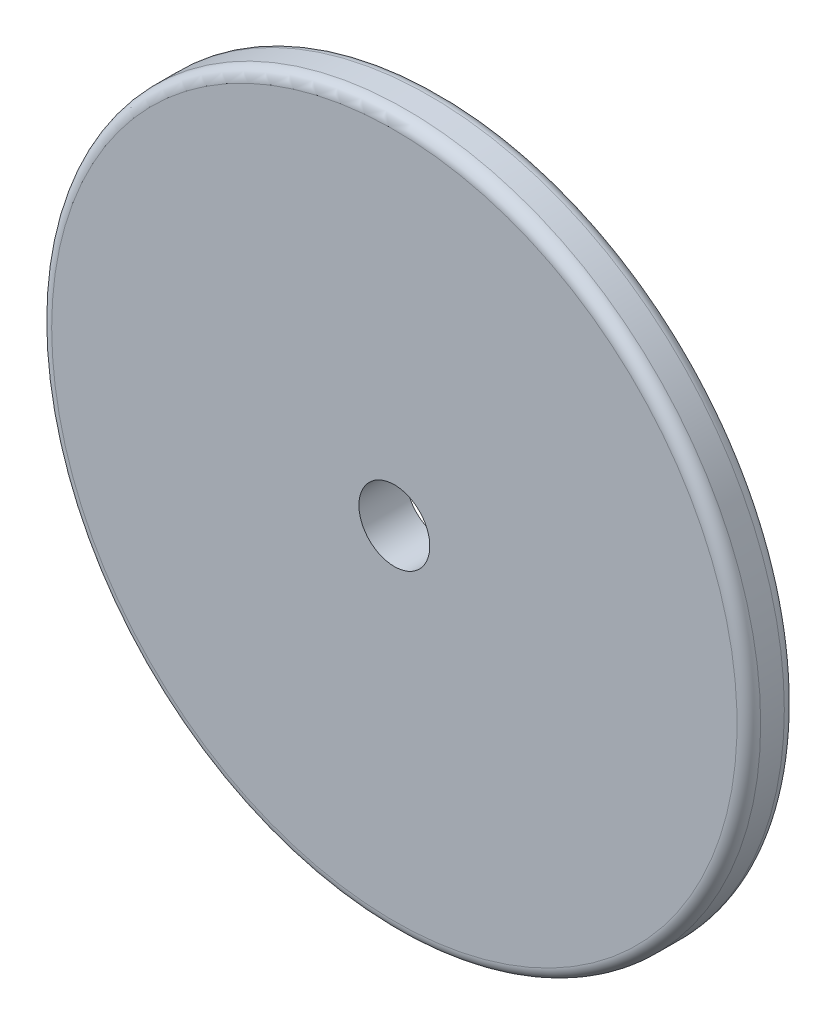
ISO-10303-21;
HEADER;
FILE_DESCRIPTION(('STEP AP214'),'2;1');
FILE_NAME('part.step','',(''),(''),'','','');
FILE_SCHEMA(('AUTOMOTIVE_DESIGN { 1 0 10303 214 1 1 1 1 }'));
ENDSEC;
DATA;
#1=APPLICATION_CONTEXT('core data for automotive mechanical design processes');
#2=APPLICATION_PROTOCOL_DEFINITION('international standard','automotive_design',2000,#1);
#3=PRODUCT_CONTEXT('',#1,'mechanical');
#4=PRODUCT('Part','Part','',(#3));
#5=PRODUCT_RELATED_PRODUCT_CATEGORY('part','',(#4));
#6=PRODUCT_DEFINITION_FORMATION('','',#4);
#7=PRODUCT_DEFINITION_CONTEXT('part definition',#1,'design');
#8=PRODUCT_DEFINITION('design','',#6,#7);
#9=PRODUCT_DEFINITION_SHAPE('','',#8);
#10=(LENGTH_UNIT() NAMED_UNIT(*) SI_UNIT(.MILLI.,.METRE.));
#11=(NAMED_UNIT(*) PLANE_ANGLE_UNIT() SI_UNIT($,.RADIAN.));
#12=(NAMED_UNIT(*) SI_UNIT($,.STERADIAN.) SOLID_ANGLE_UNIT());
#13=UNCERTAINTY_MEASURE_WITH_UNIT(LENGTH_MEASURE(1.E-05),#10,'distance_accuracy_value','');
#14=(GEOMETRIC_REPRESENTATION_CONTEXT(3) GLOBAL_UNCERTAINTY_ASSIGNED_CONTEXT((#13)) GLOBAL_UNIT_ASSIGNED_CONTEXT((#10,
#11,#12)) REPRESENTATION_CONTEXT('',''));
#15=CARTESIAN_POINT('',(0.,0.,0.));
#16=DIRECTION('',(0.,0.,1.));
#17=DIRECTION('',(1.,0.,0.));
#18=AXIS2_PLACEMENT_3D('',#15,#16,#17);
#19=CARTESIAN_POINT('',(22.8892980415492,-137.110087716454,39.8908939446721));
#20=DIRECTION('',(0.000168930064064378,7.32006556775608E-05,-0.999999983052149));
#21=DIRECTION('',(-0.999999985731317,0.,-0.00016893006451697));
#22=AXIS2_PLACEMENT_3D('',#19,#20,#21);
#23=PLANE('',#22);
#24=CARTESIAN_POINT('',(22.8892980415492,-137.110087716454,39.8908939446721));
#25=DIRECTION('',(0.000168930064064378,7.32006556775608E-05,-0.999999983052149));
#26=DIRECTION('',(-0.999999985731317,0.,-0.00016893006451697));
#27=AXIS2_PLACEMENT_3D('',#24,#25,#26);
#28=CIRCLE('',#27,14.5);
#29=CARTESIAN_POINT('',(8.38929824844514,-137.110087716454,39.8884444587366));
#30=VERTEX_POINT('',#29);
#31=EDGE_CURVE('E39',#30,#30,#28,.T.);
#32=ORIENTED_EDGE('',*,*,#31,.T.);
#33=EDGE_LOOP('',(#32));
#34=FACE_BOUND('',#33,.T.);
#35=CARTESIAN_POINT('',(22.8892980415492,-137.110087716454,39.8908939446721));
#36=DIRECTION('',(0.000168930064064378,7.32006556775608E-05,-0.999999983052149));
#37=DIRECTION('',(-0.999999985731317,0.,-0.00016893006451697));
#38=AXIS2_PLACEMENT_3D('',#35,#36,#37);
#39=CIRCLE('',#38,1.5);
#40=CARTESIAN_POINT('',(21.3892980629523,-137.110087716454,39.8906405495753));
#41=VERTEX_POINT('',#40);
#42=EDGE_CURVE('E52',#41,#41,#39,.T.);
#43=ORIENTED_EDGE('',*,*,#42,.F.);
#44=EDGE_LOOP('',(#43));
#45=FACE_BOUND('',#44,.T.);
#46=ADVANCED_FACE('F32',(#34,#45),#23,.T.);
#47=CARTESIAN_POINT('',(22.8889601814211,-137.110234117765,41.8908939107764));
#48=DIRECTION('',(0.000168930064064378,7.32006556775608E-05,-0.999999983052149));
#49=DIRECTION('',(-0.999999985731317,0.,-0.00016893006451697));
#50=AXIS2_PLACEMENT_3D('',#47,#48,#49);
#51=PLANE('',#50);
#52=CARTESIAN_POINT('',(22.8889601814211,-137.110234117765,41.8908939107764));
#53=DIRECTION('',(0.000168930064064378,7.32006556775608E-05,-0.999999983052149));
#54=DIRECTION('',(-0.999999985731317,0.,-0.00016893006451697));
#55=AXIS2_PLACEMENT_3D('',#52,#53,#54);
#56=CIRCLE('',#55,14.5);
#57=CARTESIAN_POINT('',(8.38896038831702,-137.110234117765,41.8884444248409));
#58=VERTEX_POINT('',#57);
#59=EDGE_CURVE('E43',#58,#58,#56,.F.);
#60=ORIENTED_EDGE('',*,*,#59,.T.);
#61=EDGE_LOOP('',(#60));
#62=FACE_BOUND('',#61,.T.);
#63=CARTESIAN_POINT('',(22.8889601814211,-137.110234117765,41.8908939107764));
#64=DIRECTION('',(0.000168930064064378,7.32006556775608E-05,-0.999999983052149));
#65=DIRECTION('',(-0.999999985731317,0.,-0.00016893006451697));
#66=AXIS2_PLACEMENT_3D('',#63,#64,#65);
#67=CIRCLE('',#66,1.5);
#68=CARTESIAN_POINT('',(21.3889602028241,-137.110234117765,41.8906405156796));
#69=VERTEX_POINT('',#68);
#70=EDGE_CURVE('E53',#69,#69,#67,.T.);
#71=ORIENTED_EDGE('',*,*,#70,.T.);
#72=EDGE_LOOP('',(#71));
#73=FACE_BOUND('',#72,.T.);
#74=ADVANCED_FACE('F63',(#62,#73),#51,.F.);
#75=CARTESIAN_POINT('',(22.8892980415492,-137.110087716454,39.8908939446721));
#76=DIRECTION('',(-0.000168930064064378,-7.32006556775608E-05,0.999999983052148));
#77=DIRECTION('',(0.999999985731317,0.,0.00016893006451697));
#78=AXIS2_PLACEMENT_3D('',#75,#76,#77);
#79=CYLINDRICAL_SURFACE('',#78,15.);
#80=CARTESIAN_POINT('',(22.8892135765172,-137.110124316782,40.3908939361982));
#81=DIRECTION('',(0.000168930064064378,7.32006556775608E-05,-0.999999983052149));
#82=DIRECTION('',(-0.999999985731317,0.,-0.00016893006451697));
#83=AXIS2_PLACEMENT_3D('',#80,#81,#82);
#84=CIRCLE('',#83,15.);
#85=CARTESIAN_POINT('',(7.88921379054745,-137.110124316782,40.3883599852304));
#86=VERTEX_POINT('',#85);
#87=EDGE_CURVE('E10',#86,#86,#84,.F.);
#88=ORIENTED_EDGE('',*,*,#87,.T.);
#89=EDGE_LOOP('',(#88));
#90=FACE_BOUND('',#89,.T.);
#91=CARTESIAN_POINT('',(22.8890446464531,-137.110197517437,41.3908939192503));
#92=DIRECTION('',(0.000168930064064378,7.32006556775608E-05,-0.999999983052149));
#93=DIRECTION('',(-0.999999985731317,0.,-0.00016893006451697));
#94=AXIS2_PLACEMENT_3D('',#91,#92,#93);
#95=CIRCLE('',#94,15.);
#96=CARTESIAN_POINT('',(7.88904486048339,-137.110197517437,41.3883599682826));
#97=VERTEX_POINT('',#96);
#98=EDGE_CURVE('E47',#97,#97,#95,.T.);
#99=ORIENTED_EDGE('',*,*,#98,.T.);
#100=EDGE_LOOP('',(#99));
#101=FACE_BOUND('',#100,.T.);
#102=ADVANCED_FACE('F68',(#90,#101),#79,.T.);
#103=CARTESIAN_POINT('',(22.8892980415492,-137.110087716454,39.8908939446721));
#104=DIRECTION('',(-0.000168930064064378,-7.32006556775608E-05,0.999999983052148));
#105=DIRECTION('',(0.999999985731317,0.,0.00016893006451697));
#106=AXIS2_PLACEMENT_3D('',#103,#104,#105);
#107=CYLINDRICAL_SURFACE('',#106,1.5);
#108=ORIENTED_EDGE('',*,*,#42,.T.);
#109=EDGE_LOOP('',(#108));
#110=FACE_BOUND('',#109,.T.);
#111=ORIENTED_EDGE('',*,*,#70,.F.);
#112=EDGE_LOOP('',(#111));
#113=FACE_BOUND('',#112,.T.);
#114=ADVANCED_FACE('F59',(#110,#113),#107,.F.);
#115=CARTESIAN_POINT('',(22.8890446464531,-137.110197517437,41.3908939192503));
#116=DIRECTION('',(0.000168930064064378,7.32006556775608E-05,-0.999999983052149));
#117=DIRECTION('',(-0.999999985731317,0.,-0.00016893006451697));
#118=AXIS2_PLACEMENT_3D('',#115,#116,#117);
#119=TOROIDAL_SURFACE('',#118,14.5,0.5);
#120=ORIENTED_EDGE('',*,*,#59,.F.);
#121=EDGE_LOOP('',(#120));
#122=FACE_BOUND('',#121,.T.);
#123=ORIENTED_EDGE('',*,*,#98,.F.);
#124=EDGE_LOOP('',(#123));
#125=FACE_BOUND('',#124,.T.);
#126=ADVANCED_FACE('F74',(#122,#125),#119,.T.);
#127=CARTESIAN_POINT('',(22.8892135765172,-137.110124316782,40.3908939361982));
#128=DIRECTION('',(0.000168930064064378,7.32006556775608E-05,-0.999999983052149));
#129=DIRECTION('',(-0.999999985731317,0.,-0.00016893006451697));
#130=AXIS2_PLACEMENT_3D('',#127,#128,#129);
#131=TOROIDAL_SURFACE('',#130,14.5,0.5);
#132=ORIENTED_EDGE('',*,*,#87,.F.);
#133=EDGE_LOOP('',(#132));
#134=FACE_BOUND('',#133,.T.);
#135=ORIENTED_EDGE('',*,*,#31,.F.);
#136=EDGE_LOOP('',(#135));
#137=FACE_BOUND('',#136,.T.);
#138=ADVANCED_FACE('F34',(#134,#137),#131,.T.);
#139=CLOSED_SHELL('',(#46,#74,#102,#114,#126,#138));
#140=MANIFOLD_SOLID_BREP('B2',#139);
#141=ADVANCED_BREP_SHAPE_REPRESENTATION('',(#18,#140),#14);
#142=SHAPE_DEFINITION_REPRESENTATION(#9,#141);
ENDSEC;
END-ISO-10303-21;
